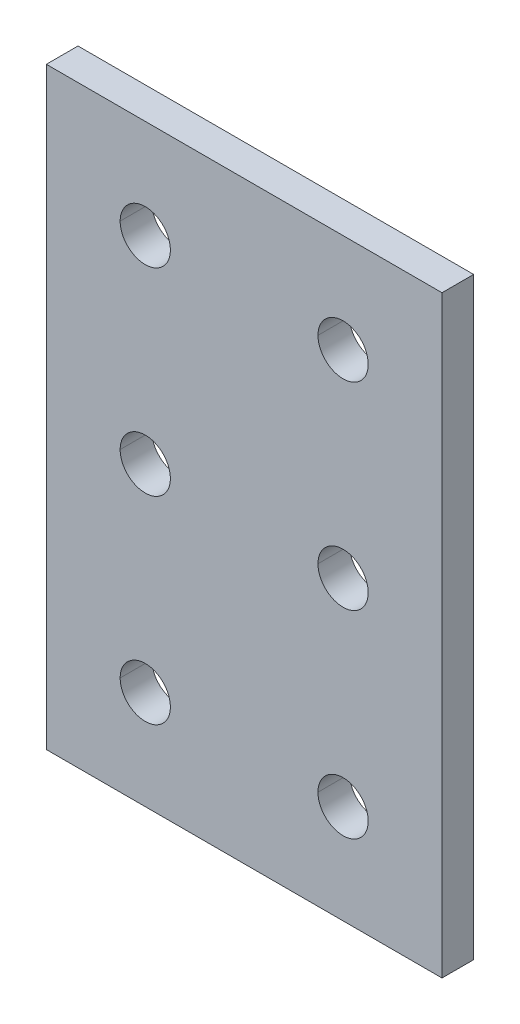
ISO-10303-21;
HEADER;
FILE_DESCRIPTION(('STEP AP214'),'2;1');
FILE_NAME('part.step','',(''),(''),'','','');
FILE_SCHEMA(('AUTOMOTIVE_DESIGN { 1 0 10303 214 1 1 1 1 }'));
ENDSEC;
DATA;
#1=APPLICATION_CONTEXT('core data for automotive mechanical design processes');
#2=APPLICATION_PROTOCOL_DEFINITION('international standard','automotive_design',2000,#1);
#3=PRODUCT_CONTEXT('',#1,'mechanical');
#4=PRODUCT('Part','Part','',(#3));
#5=PRODUCT_RELATED_PRODUCT_CATEGORY('part','',(#4));
#6=PRODUCT_DEFINITION_FORMATION('','',#4);
#7=PRODUCT_DEFINITION_CONTEXT('part definition',#1,'design');
#8=PRODUCT_DEFINITION('design','',#6,#7);
#9=PRODUCT_DEFINITION_SHAPE('','',#8);
#10=(LENGTH_UNIT() NAMED_UNIT(*) SI_UNIT(.MILLI.,.METRE.));
#11=(NAMED_UNIT(*) PLANE_ANGLE_UNIT() SI_UNIT($,.RADIAN.));
#12=(NAMED_UNIT(*) SI_UNIT($,.STERADIAN.) SOLID_ANGLE_UNIT());
#13=UNCERTAINTY_MEASURE_WITH_UNIT(LENGTH_MEASURE(1.E-05),#10,'distance_accuracy_value','');
#14=(GEOMETRIC_REPRESENTATION_CONTEXT(3) GLOBAL_UNCERTAINTY_ASSIGNED_CONTEXT((#13)) GLOBAL_UNIT_ASSIGNED_CONTEXT((#10,
#11,#12)) REPRESENTATION_CONTEXT('',''));
#15=CARTESIAN_POINT('',(0.,0.,0.));
#16=DIRECTION('',(0.,0.,1.));
#17=DIRECTION('',(1.,0.,0.));
#18=AXIS2_PLACEMENT_3D('',#15,#16,#17);
#19=CARTESIAN_POINT('',(25.,75.,4.));
#20=DIRECTION('',(0.,-1.,0.));
#21=DIRECTION('',(0.,0.,-1.));
#22=AXIS2_PLACEMENT_3D('',#19,#20,#21);
#23=PLANE('',#22);
#24=DIRECTION('',(-1.,0.,0.));
#25=VECTOR('',#24,1.);
#26=CARTESIAN_POINT('',(25.,75.,0.));
#27=LINE('',#26,#25);
#28=CARTESIAN_POINT('',(25.,75.,0.));
#29=VERTEX_POINT('',#28);
#30=CARTESIAN_POINT('',(-25.,75.,0.));
#31=VERTEX_POINT('',#30);
#32=EDGE_CURVE('E11',#29,#31,#27,.T.);
#33=ORIENTED_EDGE('',*,*,#32,.T.);
#34=DIRECTION('',(0.,0.,-1.));
#35=VECTOR('',#34,1.);
#36=CARTESIAN_POINT('',(-25.,75.,4.));
#37=LINE('',#36,#35);
#38=CARTESIAN_POINT('',(-25.,75.,4.));
#39=VERTEX_POINT('',#38);
#40=EDGE_CURVE('E24',#39,#31,#37,.T.);
#41=ORIENTED_EDGE('',*,*,#40,.F.);
#42=DIRECTION('',(-1.,0.,0.));
#43=VECTOR('',#42,1.);
#44=CARTESIAN_POINT('',(25.,75.,4.));
#45=LINE('',#44,#43);
#46=CARTESIAN_POINT('',(25.,75.,4.));
#47=VERTEX_POINT('',#46);
#48=EDGE_CURVE('E304',#47,#39,#45,.T.);
#49=ORIENTED_EDGE('',*,*,#48,.F.);
#50=DIRECTION('',(0.,0.,-1.));
#51=VECTOR('',#50,1.);
#52=CARTESIAN_POINT('',(25.,75.,4.));
#53=LINE('',#52,#51);
#54=EDGE_CURVE('E300',#47,#29,#53,.T.);
#55=ORIENTED_EDGE('',*,*,#54,.T.);
#56=EDGE_LOOP('',(#33,#41,#49,#55));
#57=FACE_BOUND('',#56,.T.);
#58=ADVANCED_FACE('F16',(#57),#23,.F.);
#59=CARTESIAN_POINT('',(25.,0.,4.));
#60=DIRECTION('',(-1.,0.,0.));
#61=DIRECTION('',(0.,0.,1.));
#62=AXIS2_PLACEMENT_3D('',#59,#60,#61);
#63=PLANE('',#62);
#64=DIRECTION('',(0.,1.,0.));
#65=VECTOR('',#64,1.);
#66=CARTESIAN_POINT('',(25.,0.,0.));
#67=LINE('',#66,#65);
#68=CARTESIAN_POINT('',(25.,0.,0.));
#69=VERTEX_POINT('',#68);
#70=EDGE_CURVE('E295',#69,#29,#67,.T.);
#71=ORIENTED_EDGE('',*,*,#70,.T.);
#72=ORIENTED_EDGE('',*,*,#54,.F.);
#73=DIRECTION('',(0.,1.,0.));
#74=VECTOR('',#73,1.);
#75=CARTESIAN_POINT('',(25.,0.,4.));
#76=LINE('',#75,#74);
#77=CARTESIAN_POINT('',(25.,0.,4.));
#78=VERTEX_POINT('',#77);
#79=EDGE_CURVE('E290',#78,#47,#76,.T.);
#80=ORIENTED_EDGE('',*,*,#79,.F.);
#81=DIRECTION('',(0.,0.,-1.));
#82=VECTOR('',#81,1.);
#83=CARTESIAN_POINT('',(25.,0.,4.));
#84=LINE('',#83,#82);
#85=EDGE_CURVE('E286',#78,#69,#84,.T.);
#86=ORIENTED_EDGE('',*,*,#85,.T.);
#87=EDGE_LOOP('',(#71,#72,#80,#86));
#88=FACE_BOUND('',#87,.T.);
#89=ADVANCED_FACE('F322',(#88),#63,.F.);
#90=CARTESIAN_POINT('',(-25.,0.,4.));
#91=DIRECTION('',(0.,1.,0.));
#92=DIRECTION('',(0.,0.,1.));
#93=AXIS2_PLACEMENT_3D('',#90,#91,#92);
#94=PLANE('',#93);
#95=DIRECTION('',(1.,0.,0.));
#96=VECTOR('',#95,1.);
#97=CARTESIAN_POINT('',(-25.,0.,0.));
#98=LINE('',#97,#96);
#99=CARTESIAN_POINT('',(-25.,0.,0.));
#100=VERTEX_POINT('',#99);
#101=EDGE_CURVE('E281',#100,#69,#98,.T.);
#102=ORIENTED_EDGE('',*,*,#101,.T.);
#103=ORIENTED_EDGE('',*,*,#85,.F.);
#104=DIRECTION('',(1.,0.,0.));
#105=VECTOR('',#104,1.);
#106=CARTESIAN_POINT('',(-25.,0.,4.));
#107=LINE('',#106,#105);
#108=CARTESIAN_POINT('',(-25.,0.,4.));
#109=VERTEX_POINT('',#108);
#110=EDGE_CURVE('E276',#109,#78,#107,.T.);
#111=ORIENTED_EDGE('',*,*,#110,.F.);
#112=DIRECTION('',(0.,0.,-1.));
#113=VECTOR('',#112,1.);
#114=CARTESIAN_POINT('',(-25.,0.,4.));
#115=LINE('',#114,#113);
#116=EDGE_CURVE('E272',#109,#100,#115,.T.);
#117=ORIENTED_EDGE('',*,*,#116,.T.);
#118=EDGE_LOOP('',(#102,#103,#111,#117));
#119=FACE_BOUND('',#118,.T.);
#120=ADVANCED_FACE('F326',(#119),#94,.F.);
#121=CARTESIAN_POINT('',(-25.,75.,4.));
#122=DIRECTION('',(1.,0.,0.));
#123=DIRECTION('',(0.,0.,-1.));
#124=AXIS2_PLACEMENT_3D('',#121,#122,#123);
#125=PLANE('',#124);
#126=DIRECTION('',(0.,-1.,0.));
#127=VECTOR('',#126,1.);
#128=CARTESIAN_POINT('',(-25.,75.,0.));
#129=LINE('',#128,#127);
#130=EDGE_CURVE('E267',#31,#100,#129,.T.);
#131=ORIENTED_EDGE('',*,*,#130,.T.);
#132=ORIENTED_EDGE('',*,*,#116,.F.);
#133=DIRECTION('',(0.,-1.,0.));
#134=VECTOR('',#133,1.);
#135=CARTESIAN_POINT('',(-25.,75.,4.));
#136=LINE('',#135,#134);
#137=EDGE_CURVE('E262',#39,#109,#136,.T.);
#138=ORIENTED_EDGE('',*,*,#137,.F.);
#139=ORIENTED_EDGE('',*,*,#40,.T.);
#140=EDGE_LOOP('',(#131,#132,#138,#139));
#141=FACE_BOUND('',#140,.T.);
#142=ADVANCED_FACE('F314',(#141),#125,.F.);
#143=CARTESIAN_POINT('',(0.,0.,4.));
#144=DIRECTION('',(0.,0.,1.));
#145=DIRECTION('',(1.,0.,0.));
#146=AXIS2_PLACEMENT_3D('',#143,#144,#145);
#147=PLANE('',#146);
#148=CARTESIAN_POINT('',(-12.5,62.5,4.));
#149=DIRECTION('',(0.,0.,1.));
#150=DIRECTION('',(1.,0.,0.));
#151=AXIS2_PLACEMENT_3D('',#148,#149,#150);
#152=CIRCLE('',#151,3.175);
#153=CARTESIAN_POINT('',(-15.675,62.5,4.));
#154=VERTEX_POINT('',#153);
#155=CARTESIAN_POINT('',(-9.325,62.5,4.));
#156=VERTEX_POINT('',#155);
#157=EDGE_CURVE('E257',#154,#156,#152,.T.);
#158=ORIENTED_EDGE('',*,*,#157,.F.);
#159=CARTESIAN_POINT('',(-12.5,62.5,4.));
#160=DIRECTION('',(0.,0.,1.));
#161=DIRECTION('',(1.,0.,0.));
#162=AXIS2_PLACEMENT_3D('',#159,#160,#161);
#163=CIRCLE('',#162,3.175);
#164=EDGE_CURVE('E252',#156,#154,#163,.T.);
#165=ORIENTED_EDGE('',*,*,#164,.F.);
#166=EDGE_LOOP('',(#158,#165));
#167=FACE_BOUND('',#166,.T.);
#168=CARTESIAN_POINT('',(-12.5,37.5,4.));
#169=DIRECTION('',(0.,0.,1.));
#170=DIRECTION('',(1.,0.,0.));
#171=AXIS2_PLACEMENT_3D('',#168,#169,#170);
#172=CIRCLE('',#171,3.175);
#173=CARTESIAN_POINT('',(-15.675,37.5,4.));
#174=VERTEX_POINT('',#173);
#175=CARTESIAN_POINT('',(-9.325,37.5,4.));
#176=VERTEX_POINT('',#175);
#177=EDGE_CURVE('E247',#174,#176,#172,.T.);
#178=ORIENTED_EDGE('',*,*,#177,.F.);
#179=CARTESIAN_POINT('',(-12.5,37.5,4.));
#180=DIRECTION('',(0.,0.,1.));
#181=DIRECTION('',(1.,0.,0.));
#182=AXIS2_PLACEMENT_3D('',#179,#180,#181);
#183=CIRCLE('',#182,3.175);
#184=EDGE_CURVE('E242',#176,#174,#183,.T.);
#185=ORIENTED_EDGE('',*,*,#184,.F.);
#186=EDGE_LOOP('',(#178,#185));
#187=FACE_BOUND('',#186,.T.);
#188=CARTESIAN_POINT('',(-12.5,12.5,4.));
#189=DIRECTION('',(0.,0.,1.));
#190=DIRECTION('',(1.,0.,0.));
#191=AXIS2_PLACEMENT_3D('',#188,#189,#190);
#192=CIRCLE('',#191,3.175);
#193=CARTESIAN_POINT('',(-15.675,12.5,4.));
#194=VERTEX_POINT('',#193);
#195=CARTESIAN_POINT('',(-9.325,12.5,4.));
#196=VERTEX_POINT('',#195);
#197=EDGE_CURVE('E237',#194,#196,#192,.T.);
#198=ORIENTED_EDGE('',*,*,#197,.F.);
#199=CARTESIAN_POINT('',(-12.5,12.5,4.));
#200=DIRECTION('',(0.,0.,1.));
#201=DIRECTION('',(1.,0.,0.));
#202=AXIS2_PLACEMENT_3D('',#199,#200,#201);
#203=CIRCLE('',#202,3.175);
#204=EDGE_CURVE('E232',#196,#194,#203,.T.);
#205=ORIENTED_EDGE('',*,*,#204,.F.);
#206=EDGE_LOOP('',(#198,#205));
#207=FACE_BOUND('',#206,.T.);
#208=CARTESIAN_POINT('',(12.5,62.5,4.));
#209=DIRECTION('',(0.,0.,1.));
#210=DIRECTION('',(1.,0.,0.));
#211=AXIS2_PLACEMENT_3D('',#208,#209,#210);
#212=CIRCLE('',#211,3.175);
#213=CARTESIAN_POINT('',(9.325,62.5,4.));
#214=VERTEX_POINT('',#213);
#215=CARTESIAN_POINT('',(15.675,62.5,4.));
#216=VERTEX_POINT('',#215);
#217=EDGE_CURVE('E227',#214,#216,#212,.T.);
#218=ORIENTED_EDGE('',*,*,#217,.F.);
#219=CARTESIAN_POINT('',(12.5,62.5,4.));
#220=DIRECTION('',(0.,0.,1.));
#221=DIRECTION('',(1.,0.,0.));
#222=AXIS2_PLACEMENT_3D('',#219,#220,#221);
#223=CIRCLE('',#222,3.175);
#224=EDGE_CURVE('E222',#216,#214,#223,.T.);
#225=ORIENTED_EDGE('',*,*,#224,.F.);
#226=EDGE_LOOP('',(#218,#225));
#227=FACE_BOUND('',#226,.T.);
#228=CARTESIAN_POINT('',(12.5,37.5,4.));
#229=DIRECTION('',(0.,0.,1.));
#230=DIRECTION('',(1.,0.,0.));
#231=AXIS2_PLACEMENT_3D('',#228,#229,#230);
#232=CIRCLE('',#231,3.175);
#233=CARTESIAN_POINT('',(9.325,37.5,4.));
#234=VERTEX_POINT('',#233);
#235=CARTESIAN_POINT('',(15.675,37.5,4.));
#236=VERTEX_POINT('',#235);
#237=EDGE_CURVE('E145',#234,#236,#232,.T.);
#238=ORIENTED_EDGE('',*,*,#237,.F.);
#239=CARTESIAN_POINT('',(12.5,37.5,4.));
#240=DIRECTION('',(0.,0.,1.));
#241=DIRECTION('',(1.,0.,0.));
#242=AXIS2_PLACEMENT_3D('',#239,#240,#241);
#243=CIRCLE('',#242,3.175);
#244=EDGE_CURVE('E215',#236,#234,#243,.T.);
#245=ORIENTED_EDGE('',*,*,#244,.F.);
#246=EDGE_LOOP('',(#238,#245));
#247=FACE_BOUND('',#246,.T.);
#248=CARTESIAN_POINT('',(12.5,12.5,4.));
#249=DIRECTION('',(0.,0.,1.));
#250=DIRECTION('',(1.,0.,0.));
#251=AXIS2_PLACEMENT_3D('',#248,#249,#250);
#252=CIRCLE('',#251,3.175);
#253=CARTESIAN_POINT('',(9.325,12.5,4.));
#254=VERTEX_POINT('',#253);
#255=CARTESIAN_POINT('',(15.675,12.5,4.));
#256=VERTEX_POINT('',#255);
#257=EDGE_CURVE('E210',#254,#256,#252,.T.);
#258=ORIENTED_EDGE('',*,*,#257,.F.);
#259=CARTESIAN_POINT('',(12.5,12.5,4.));
#260=DIRECTION('',(0.,0.,1.));
#261=DIRECTION('',(1.,0.,0.));
#262=AXIS2_PLACEMENT_3D('',#259,#260,#261);
#263=CIRCLE('',#262,3.175);
#264=EDGE_CURVE('E205',#256,#254,#263,.T.);
#265=ORIENTED_EDGE('',*,*,#264,.F.);
#266=EDGE_LOOP('',(#258,#265));
#267=FACE_BOUND('',#266,.T.);
#268=ORIENTED_EDGE('',*,*,#48,.T.);
#269=ORIENTED_EDGE('',*,*,#137,.T.);
#270=ORIENTED_EDGE('',*,*,#110,.T.);
#271=ORIENTED_EDGE('',*,*,#79,.T.);
#272=EDGE_LOOP('',(#268,#269,#270,#271));
#273=FACE_BOUND('',#272,.T.);
#274=ADVANCED_FACE('F318',(#167,#187,#207,#227,#247,#267,#273),#147,.T.);
#275=CARTESIAN_POINT('',(12.5,12.5,4.));
#276=DIRECTION('',(0.,0.,-1.));
#277=DIRECTION('',(0.,-1.,0.));
#278=AXIS2_PLACEMENT_3D('',#275,#276,#277);
#279=CYLINDRICAL_SURFACE('',#278,3.175);
#280=DIRECTION('',(0.,0.,-1.));
#281=VECTOR('',#280,1.);
#282=CARTESIAN_POINT('',(15.675,12.5,4.));
#283=LINE('',#282,#281);
#284=CARTESIAN_POINT('',(15.675,12.5,0.));
#285=VERTEX_POINT('',#284);
#286=EDGE_CURVE('E200',#256,#285,#283,.T.);
#287=ORIENTED_EDGE('',*,*,#286,.F.);
#288=ORIENTED_EDGE('',*,*,#264,.T.);
#289=DIRECTION('',(0.,0.,-1.));
#290=VECTOR('',#289,1.);
#291=CARTESIAN_POINT('',(9.325,12.5,4.));
#292=LINE('',#291,#290);
#293=CARTESIAN_POINT('',(9.325,12.5,0.));
#294=VERTEX_POINT('',#293);
#295=EDGE_CURVE('E196',#254,#294,#292,.T.);
#296=ORIENTED_EDGE('',*,*,#295,.T.);
#297=CARTESIAN_POINT('',(12.5,12.5,0.));
#298=DIRECTION('',(0.,0.,1.));
#299=DIRECTION('',(1.,0.,0.));
#300=AXIS2_PLACEMENT_3D('',#297,#298,#299);
#301=CIRCLE('',#300,3.175);
#302=EDGE_CURVE('E191',#285,#294,#301,.T.);
#303=ORIENTED_EDGE('',*,*,#302,.F.);
#304=EDGE_LOOP('',(#287,#288,#296,#303));
#305=FACE_BOUND('',#304,.T.);
#306=ADVANCED_FACE('F370',(#305),#279,.F.);
#307=CARTESIAN_POINT('',(0.,0.,0.));
#308=DIRECTION('',(0.,0.,1.));
#309=DIRECTION('',(1.,0.,0.));
#310=AXIS2_PLACEMENT_3D('',#307,#308,#309);
#311=PLANE('',#310);
#312=CARTESIAN_POINT('',(-12.5,62.5,0.));
#313=DIRECTION('',(0.,0.,1.));
#314=DIRECTION('',(1.,0.,0.));
#315=AXIS2_PLACEMENT_3D('',#312,#313,#314);
#316=CIRCLE('',#315,3.175);
#317=CARTESIAN_POINT('',(-9.325,62.5,0.));
#318=VERTEX_POINT('',#317);
#319=CARTESIAN_POINT('',(-15.675,62.5,0.));
#320=VERTEX_POINT('',#319);
#321=EDGE_CURVE('E187',#318,#320,#316,.T.);
#322=ORIENTED_EDGE('',*,*,#321,.T.);
#323=CARTESIAN_POINT('',(-12.5,62.5,0.));
#324=DIRECTION('',(0.,0.,1.));
#325=DIRECTION('',(1.,0.,0.));
#326=AXIS2_PLACEMENT_3D('',#323,#324,#325);
#327=CIRCLE('',#326,3.175);
#328=EDGE_CURVE('E183',#320,#318,#327,.T.);
#329=ORIENTED_EDGE('',*,*,#328,.T.);
#330=EDGE_LOOP('',(#322,#329));
#331=FACE_BOUND('',#330,.T.);
#332=CARTESIAN_POINT('',(-12.5,37.5,0.));
#333=DIRECTION('',(0.,0.,1.));
#334=DIRECTION('',(1.,0.,0.));
#335=AXIS2_PLACEMENT_3D('',#332,#333,#334);
#336=CIRCLE('',#335,3.175);
#337=CARTESIAN_POINT('',(-9.325,37.5,0.));
#338=VERTEX_POINT('',#337);
#339=CARTESIAN_POINT('',(-15.675,37.5,0.));
#340=VERTEX_POINT('',#339);
#341=EDGE_CURVE('E179',#338,#340,#336,.T.);
#342=ORIENTED_EDGE('',*,*,#341,.T.);
#343=CARTESIAN_POINT('',(-12.5,37.5,0.));
#344=DIRECTION('',(0.,0.,1.));
#345=DIRECTION('',(1.,0.,0.));
#346=AXIS2_PLACEMENT_3D('',#343,#344,#345);
#347=CIRCLE('',#346,3.175);
#348=EDGE_CURVE('E175',#340,#338,#347,.T.);
#349=ORIENTED_EDGE('',*,*,#348,.T.);
#350=EDGE_LOOP('',(#342,#349));
#351=FACE_BOUND('',#350,.T.);
#352=CARTESIAN_POINT('',(-12.5,12.5,0.));
#353=DIRECTION('',(0.,0.,1.));
#354=DIRECTION('',(1.,0.,0.));
#355=AXIS2_PLACEMENT_3D('',#352,#353,#354);
#356=CIRCLE('',#355,3.175);
#357=CARTESIAN_POINT('',(-9.325,12.5,0.));
#358=VERTEX_POINT('',#357);
#359=CARTESIAN_POINT('',(-15.675,12.5,0.));
#360=VERTEX_POINT('',#359);
#361=EDGE_CURVE('E171',#358,#360,#356,.T.);
#362=ORIENTED_EDGE('',*,*,#361,.T.);
#363=CARTESIAN_POINT('',(-12.5,12.5,0.));
#364=DIRECTION('',(0.,0.,1.));
#365=DIRECTION('',(1.,0.,0.));
#366=AXIS2_PLACEMENT_3D('',#363,#364,#365);
#367=CIRCLE('',#366,3.175);
#368=EDGE_CURVE('E167',#360,#358,#367,.T.);
#369=ORIENTED_EDGE('',*,*,#368,.T.);
#370=EDGE_LOOP('',(#362,#369));
#371=FACE_BOUND('',#370,.T.);
#372=CARTESIAN_POINT('',(12.5,62.5,0.));
#373=DIRECTION('',(0.,0.,1.));
#374=DIRECTION('',(1.,0.,0.));
#375=AXIS2_PLACEMENT_3D('',#372,#373,#374);
#376=CIRCLE('',#375,3.175);
#377=CARTESIAN_POINT('',(15.675,62.5,0.));
#378=VERTEX_POINT('',#377);
#379=CARTESIAN_POINT('',(9.325,62.5,0.));
#380=VERTEX_POINT('',#379);
#381=EDGE_CURVE('E163',#378,#380,#376,.T.);
#382=ORIENTED_EDGE('',*,*,#381,.T.);
#383=CARTESIAN_POINT('',(12.5,62.5,0.));
#384=DIRECTION('',(0.,0.,1.));
#385=DIRECTION('',(1.,0.,0.));
#386=AXIS2_PLACEMENT_3D('',#383,#384,#385);
#387=CIRCLE('',#386,3.175);
#388=EDGE_CURVE('E142',#380,#378,#387,.T.);
#389=ORIENTED_EDGE('',*,*,#388,.T.);
#390=EDGE_LOOP('',(#382,#389));
#391=FACE_BOUND('',#390,.T.);
#392=CARTESIAN_POINT('',(12.5,37.5,0.));
#393=DIRECTION('',(0.,0.,1.));
#394=DIRECTION('',(1.,0.,0.));
#395=AXIS2_PLACEMENT_3D('',#392,#393,#394);
#396=CIRCLE('',#395,3.175);
#397=CARTESIAN_POINT('',(15.675,37.5,0.));
#398=VERTEX_POINT('',#397);
#399=CARTESIAN_POINT('',(9.325,37.5,0.));
#400=VERTEX_POINT('',#399);
#401=EDGE_CURVE('E128',#398,#400,#396,.T.);
#402=ORIENTED_EDGE('',*,*,#401,.T.);
#403=CARTESIAN_POINT('',(12.5,37.5,0.));
#404=DIRECTION('',(0.,0.,1.));
#405=DIRECTION('',(1.,0.,0.));
#406=AXIS2_PLACEMENT_3D('',#403,#404,#405);
#407=CIRCLE('',#406,3.175);
#408=EDGE_CURVE('E124',#400,#398,#407,.T.);
#409=ORIENTED_EDGE('',*,*,#408,.T.);
#410=EDGE_LOOP('',(#402,#409));
#411=FACE_BOUND('',#410,.T.);
#412=ORIENTED_EDGE('',*,*,#302,.T.);
#413=CARTESIAN_POINT('',(12.5,12.5,0.));
#414=DIRECTION('',(0.,0.,1.));
#415=DIRECTION('',(1.,0.,0.));
#416=AXIS2_PLACEMENT_3D('',#413,#414,#415);
#417=CIRCLE('',#416,3.175);
#418=EDGE_CURVE('E133',#294,#285,#417,.T.);
#419=ORIENTED_EDGE('',*,*,#418,.T.);
#420=EDGE_LOOP('',(#412,#419));
#421=FACE_BOUND('',#420,.T.);
#422=ORIENTED_EDGE('',*,*,#32,.F.);
#423=ORIENTED_EDGE('',*,*,#70,.F.);
#424=ORIENTED_EDGE('',*,*,#101,.F.);
#425=ORIENTED_EDGE('',*,*,#130,.F.);
#426=EDGE_LOOP('',(#422,#423,#424,#425));
#427=FACE_BOUND('',#426,.T.);
#428=ADVANCED_FACE('F126',(#331,#351,#371,#391,#411,#421,#427),#311,.F.);
#429=CARTESIAN_POINT('',(12.5,12.5,4.));
#430=DIRECTION('',(0.,0.,-1.));
#431=DIRECTION('',(0.,1.,0.));
#432=AXIS2_PLACEMENT_3D('',#429,#430,#431);
#433=CYLINDRICAL_SURFACE('',#432,3.175);
#434=ORIENTED_EDGE('',*,*,#286,.T.);
#435=ORIENTED_EDGE('',*,*,#418,.F.);
#436=ORIENTED_EDGE('',*,*,#295,.F.);
#437=ORIENTED_EDGE('',*,*,#257,.T.);
#438=EDGE_LOOP('',(#434,#435,#436,#437));
#439=FACE_BOUND('',#438,.T.);
#440=ADVANCED_FACE('F391',(#439),#433,.F.);
#441=CARTESIAN_POINT('',(12.5,37.5,4.));
#442=DIRECTION('',(0.,0.,-1.));
#443=DIRECTION('',(0.,1.,0.));
#444=AXIS2_PLACEMENT_3D('',#441,#442,#443);
#445=CYLINDRICAL_SURFACE('',#444,3.175);
#446=DIRECTION('',(0.,0.,-1.));
#447=VECTOR('',#446,1.);
#448=CARTESIAN_POINT('',(15.675,37.5,4.));
#449=LINE('',#448,#447);
#450=EDGE_CURVE('E139',#236,#398,#449,.T.);
#451=ORIENTED_EDGE('',*,*,#450,.T.);
#452=ORIENTED_EDGE('',*,*,#408,.F.);
#453=DIRECTION('',(0.,0.,-1.));
#454=VECTOR('',#453,1.);
#455=CARTESIAN_POINT('',(9.325,37.5,4.));
#456=LINE('',#455,#454);
#457=EDGE_CURVE('E141',#234,#400,#456,.T.);
#458=ORIENTED_EDGE('',*,*,#457,.F.);
#459=ORIENTED_EDGE('',*,*,#237,.T.);
#460=EDGE_LOOP('',(#451,#452,#458,#459));
#461=FACE_BOUND('',#460,.T.);
#462=ADVANCED_FACE('F144',(#461),#445,.F.);
#463=CARTESIAN_POINT('',(12.5,37.5,4.));
#464=DIRECTION('',(0.,0.,-1.));
#465=DIRECTION('',(0.,-1.,0.));
#466=AXIS2_PLACEMENT_3D('',#463,#464,#465);
#467=CYLINDRICAL_SURFACE('',#466,3.175);
#468=ORIENTED_EDGE('',*,*,#450,.F.);
#469=ORIENTED_EDGE('',*,*,#244,.T.);
#470=ORIENTED_EDGE('',*,*,#457,.T.);
#471=ORIENTED_EDGE('',*,*,#401,.F.);
#472=EDGE_LOOP('',(#468,#469,#470,#471));
#473=FACE_BOUND('',#472,.T.);
#474=ADVANCED_FACE('F137',(#473),#467,.F.);
#475=CARTESIAN_POINT('',(12.5,62.5,4.));
#476=DIRECTION('',(0.,0.,-1.));
#477=DIRECTION('',(0.,1.,0.));
#478=AXIS2_PLACEMENT_3D('',#475,#476,#477);
#479=CYLINDRICAL_SURFACE('',#478,3.175);
#480=DIRECTION('',(0.,0.,-1.));
#481=VECTOR('',#480,1.);
#482=CARTESIAN_POINT('',(15.675,62.5,4.));
#483=LINE('',#482,#481);
#484=EDGE_CURVE('E149',#216,#378,#483,.T.);
#485=ORIENTED_EDGE('',*,*,#484,.T.);
#486=ORIENTED_EDGE('',*,*,#388,.F.);
#487=DIRECTION('',(0.,0.,-1.));
#488=VECTOR('',#487,1.);
#489=CARTESIAN_POINT('',(9.325,62.5,4.));
#490=LINE('',#489,#488);
#491=EDGE_CURVE('E563',#214,#380,#490,.T.);
#492=ORIENTED_EDGE('',*,*,#491,.F.);
#493=ORIENTED_EDGE('',*,*,#217,.T.);
#494=EDGE_LOOP('',(#485,#486,#492,#493));
#495=FACE_BOUND('',#494,.T.);
#496=ADVANCED_FACE('F421',(#495),#479,.F.);
#497=CARTESIAN_POINT('',(12.5,62.5,4.));
#498=DIRECTION('',(0.,0.,-1.));
#499=DIRECTION('',(0.,-1.,0.));
#500=AXIS2_PLACEMENT_3D('',#497,#498,#499);
#501=CYLINDRICAL_SURFACE('',#500,3.175);
#502=ORIENTED_EDGE('',*,*,#484,.F.);
#503=ORIENTED_EDGE('',*,*,#224,.T.);
#504=ORIENTED_EDGE('',*,*,#491,.T.);
#505=ORIENTED_EDGE('',*,*,#381,.F.);
#506=EDGE_LOOP('',(#502,#503,#504,#505));
#507=FACE_BOUND('',#506,.T.);
#508=ADVANCED_FACE('F431',(#507),#501,.F.);
#509=CARTESIAN_POINT('',(-12.5,12.5,4.));
#510=DIRECTION('',(0.,0.,-1.));
#511=DIRECTION('',(0.,1.,0.));
#512=AXIS2_PLACEMENT_3D('',#509,#510,#511);
#513=CYLINDRICAL_SURFACE('',#512,3.175);
#514=DIRECTION('',(0.,0.,-1.));
#515=VECTOR('',#514,1.);
#516=CARTESIAN_POINT('',(-9.325,12.5,4.));
#517=LINE('',#516,#515);
#518=EDGE_CURVE('E565',#196,#358,#517,.T.);
#519=ORIENTED_EDGE('',*,*,#518,.T.);
#520=ORIENTED_EDGE('',*,*,#368,.F.);
#521=DIRECTION('',(0.,0.,-1.));
#522=VECTOR('',#521,1.);
#523=CARTESIAN_POINT('',(-15.675,12.5,4.));
#524=LINE('',#523,#522);
#525=EDGE_CURVE('E577',#194,#360,#524,.T.);
#526=ORIENTED_EDGE('',*,*,#525,.F.);
#527=ORIENTED_EDGE('',*,*,#197,.T.);
#528=EDGE_LOOP('',(#519,#520,#526,#527));
#529=FACE_BOUND('',#528,.T.);
#530=ADVANCED_FACE('F442',(#529),#513,.F.);
#531=CARTESIAN_POINT('',(-12.5,12.5,4.));
#532=DIRECTION('',(0.,0.,-1.));
#533=DIRECTION('',(0.,-1.,0.));
#534=AXIS2_PLACEMENT_3D('',#531,#532,#533);
#535=CYLINDRICAL_SURFACE('',#534,3.175);
#536=ORIENTED_EDGE('',*,*,#518,.F.);
#537=ORIENTED_EDGE('',*,*,#204,.T.);
#538=ORIENTED_EDGE('',*,*,#525,.T.);
#539=ORIENTED_EDGE('',*,*,#361,.F.);
#540=EDGE_LOOP('',(#536,#537,#538,#539));
#541=FACE_BOUND('',#540,.T.);
#542=ADVANCED_FACE('F453',(#541),#535,.F.);
#543=CARTESIAN_POINT('',(-12.5,37.5,4.));
#544=DIRECTION('',(0.,0.,-1.));
#545=DIRECTION('',(0.,1.,0.));
#546=AXIS2_PLACEMENT_3D('',#543,#544,#545);
#547=CYLINDRICAL_SURFACE('',#546,3.175);
#548=DIRECTION('',(0.,0.,-1.));
#549=VECTOR('',#548,1.);
#550=CARTESIAN_POINT('',(-9.325,37.5,4.));
#551=LINE('',#550,#549);
#552=EDGE_CURVE('E582',#176,#338,#551,.T.);
#553=ORIENTED_EDGE('',*,*,#552,.T.);
#554=ORIENTED_EDGE('',*,*,#348,.F.);
#555=DIRECTION('',(0.,0.,-1.));
#556=VECTOR('',#555,1.);
#557=CARTESIAN_POINT('',(-15.675,37.5,4.));
#558=LINE('',#557,#556);
#559=EDGE_CURVE('E544',#174,#340,#558,.T.);
#560=ORIENTED_EDGE('',*,*,#559,.F.);
#561=ORIENTED_EDGE('',*,*,#177,.T.);
#562=EDGE_LOOP('',(#553,#554,#560,#561));
#563=FACE_BOUND('',#562,.T.);
#564=ADVANCED_FACE('F464',(#563),#547,.F.);
#565=CARTESIAN_POINT('',(-12.5,37.5,4.));
#566=DIRECTION('',(0.,0.,-1.));
#567=DIRECTION('',(0.,-1.,0.));
#568=AXIS2_PLACEMENT_3D('',#565,#566,#567);
#569=CYLINDRICAL_SURFACE('',#568,3.175);
#570=ORIENTED_EDGE('',*,*,#552,.F.);
#571=ORIENTED_EDGE('',*,*,#184,.T.);
#572=ORIENTED_EDGE('',*,*,#559,.T.);
#573=ORIENTED_EDGE('',*,*,#341,.F.);
#574=EDGE_LOOP('',(#570,#571,#572,#573));
#575=FACE_BOUND('',#574,.T.);
#576=ADVANCED_FACE('F475',(#575),#569,.F.);
#577=CARTESIAN_POINT('',(-12.5,62.5,4.));
#578=DIRECTION('',(0.,0.,-1.));
#579=DIRECTION('',(0.,1.,0.));
#580=AXIS2_PLACEMENT_3D('',#577,#578,#579);
#581=CYLINDRICAL_SURFACE('',#580,3.175);
#582=DIRECTION('',(0.,0.,-1.));
#583=VECTOR('',#582,1.);
#584=CARTESIAN_POINT('',(-9.325,62.5,4.));
#585=LINE('',#584,#583);
#586=EDGE_CURVE('E541',#156,#318,#585,.T.);
#587=ORIENTED_EDGE('',*,*,#586,.T.);
#588=ORIENTED_EDGE('',*,*,#328,.F.);
#589=DIRECTION('',(0.,0.,-1.));
#590=VECTOR('',#589,1.);
#591=CARTESIAN_POINT('',(-15.675,62.5,4.));
#592=LINE('',#591,#590);
#593=EDGE_CURVE('E545',#154,#320,#592,.T.);
#594=ORIENTED_EDGE('',*,*,#593,.F.);
#595=ORIENTED_EDGE('',*,*,#157,.T.);
#596=EDGE_LOOP('',(#587,#588,#594,#595));
#597=FACE_BOUND('',#596,.T.);
#598=ADVANCED_FACE('F486',(#597),#581,.F.);
#599=CARTESIAN_POINT('',(-12.5,62.5,4.));
#600=DIRECTION('',(0.,0.,-1.));
#601=DIRECTION('',(0.,-1.,0.));
#602=AXIS2_PLACEMENT_3D('',#599,#600,#601);
#603=CYLINDRICAL_SURFACE('',#602,3.175);
#604=ORIENTED_EDGE('',*,*,#586,.F.);
#605=ORIENTED_EDGE('',*,*,#164,.T.);
#606=ORIENTED_EDGE('',*,*,#593,.T.);
#607=ORIENTED_EDGE('',*,*,#321,.F.);
#608=EDGE_LOOP('',(#604,#605,#606,#607));
#609=FACE_BOUND('',#608,.T.);
#610=ADVANCED_FACE('F497',(#609),#603,.F.);
#611=CLOSED_SHELL('',(#58,#89,#120,#142,#274,#306,#428,#440,#462,#474,#496,#508,#530,#542,#564,
#576,#598,#610));
#612=MANIFOLD_SOLID_BREP('B1',#611);
#613=ADVANCED_BREP_SHAPE_REPRESENTATION('',(#18,#612),#14);
#614=SHAPE_DEFINITION_REPRESENTATION(#9,#613);
ENDSEC;
END-ISO-10303-21;
